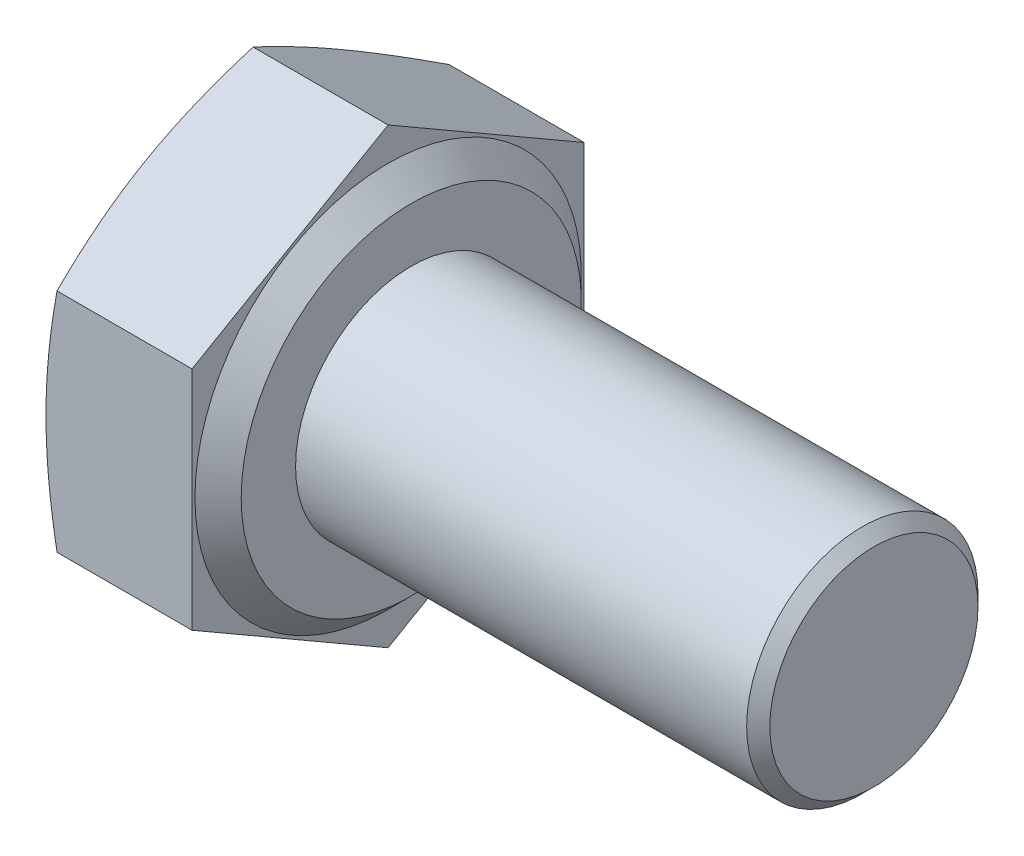
ISO-10303-21;
HEADER;
FILE_DESCRIPTION(('STEP AP214'),'2;1');
FILE_NAME('part.step','',(''),(''),'','','');
FILE_SCHEMA(('AUTOMOTIVE_DESIGN { 1 0 10303 214 1 1 1 1 }'));
ENDSEC;
DATA;
#1=APPLICATION_CONTEXT('core data for automotive mechanical design processes');
#2=APPLICATION_PROTOCOL_DEFINITION('international standard','automotive_design',2000,#1);
#3=PRODUCT_CONTEXT('',#1,'mechanical');
#4=PRODUCT('Part','Part','',(#3));
#5=PRODUCT_RELATED_PRODUCT_CATEGORY('part','',(#4));
#6=PRODUCT_DEFINITION_FORMATION('','',#4);
#7=PRODUCT_DEFINITION_CONTEXT('part definition',#1,'design');
#8=PRODUCT_DEFINITION('design','',#6,#7);
#9=PRODUCT_DEFINITION_SHAPE('','',#8);
#10=(LENGTH_UNIT() NAMED_UNIT(*) SI_UNIT(.MILLI.,.METRE.));
#11=(NAMED_UNIT(*) PLANE_ANGLE_UNIT() SI_UNIT($,.RADIAN.));
#12=(NAMED_UNIT(*) SI_UNIT($,.STERADIAN.) SOLID_ANGLE_UNIT());
#13=UNCERTAINTY_MEASURE_WITH_UNIT(LENGTH_MEASURE(1.E-05),#10,'distance_accuracy_value','');
#14=(GEOMETRIC_REPRESENTATION_CONTEXT(3) GLOBAL_UNCERTAINTY_ASSIGNED_CONTEXT((#13)) GLOBAL_UNIT_ASSIGNED_CONTEXT((#10,
#11,#12)) REPRESENTATION_CONTEXT('',''));
#15=CARTESIAN_POINT('',(0.,0.,0.));
#16=DIRECTION('',(0.,0.,1.));
#17=DIRECTION('',(1.,0.,0.));
#18=AXIS2_PLACEMENT_3D('',#15,#16,#17);
#19=CARTESIAN_POINT('',(2.925,-5.87165223765849,3.39));
#20=DIRECTION('',(-1.,0.,0.));
#21=DIRECTION('',(0.,0.,1.));
#22=AXIS2_PLACEMENT_3D('',#19,#20,#21);
#23=PLANE('',#22);
#24=CARTESIAN_POINT('',(2.925,0.,0.));
#25=DIRECTION('',(-1.,0.,0.));
#26=DIRECTION('',(0.,0.,1.));
#27=AXIS2_PLACEMENT_3D('',#24,#25,#26);
#28=CIRCLE('',#27,2.94);
#29=CARTESIAN_POINT('',(2.925,0.,2.94));
#30=VERTEX_POINT('',#29);
#31=EDGE_CURVE('E338',#30,#30,#28,.T.);
#32=ORIENTED_EDGE('',*,*,#31,.F.);
#33=EDGE_LOOP('',(#32));
#34=FACE_BOUND('',#33,.T.);
#35=CARTESIAN_POINT('',(2.925,0.,0.));
#36=DIRECTION('',(-1.,0.,0.));
#37=DIRECTION('',(0.,0.,1.));
#38=AXIS2_PLACEMENT_3D('',#35,#36,#37);
#39=CIRCLE('',#38,2.);
#40=CARTESIAN_POINT('',(2.925,0.,2.));
#41=VERTEX_POINT('',#40);
#42=EDGE_CURVE('E153',#41,#41,#39,.F.);
#43=ORIENTED_EDGE('',*,*,#42,.F.);
#44=EDGE_LOOP('',(#43));
#45=FACE_BOUND('',#44,.T.);
#46=ADVANCED_FACE('F37',(#34,#45),#23,.F.);
#47=CARTESIAN_POINT('',(2.925,-3.91443482510566,0.));
#48=DIRECTION('',(0.,0.866025403784439,0.5));
#49=DIRECTION('',(0.,-0.5,0.866025403784439));
#50=AXIS2_PLACEMENT_3D('',#47,#48,#49);
#51=PLANE('',#50);
#52=CARTESIAN_POINT('',(0.190920695673181,-1.957101942499,-3.3902));
#53=CARTESIAN_POINT('',(0.161404170530894,-2.03816412054654,-3.24979618904946));
#54=CARTESIAN_POINT('',(0.134553686064012,-2.11949362286094,-3.10892935888662));
#55=CARTESIAN_POINT('',(0.0873142945927187,-2.28268148917413,-2.82627968325342));
#56=CARTESIAN_POINT('',(0.0669304448507112,-2.36454021625955,-2.68449620889857));
#57=CARTESIAN_POINT('',(0.0339601092717296,-2.52787800101785,-2.40158686690143));
#58=CARTESIAN_POINT('',(0.0213017035221391,-2.6093533276861,-2.26046746154876));
#59=CARTESIAN_POINT('',(0.00432321252371582,-2.77249453116584,-1.97789860831391));
#60=CARTESIAN_POINT('',(0.,-2.85416032499754,-1.83644930415696));
#61=CARTESIAN_POINT('',(0.,-3.01749191266095,-1.55355069584304));
#62=CARTESIAN_POINT('',(0.00432321252371608,-3.09915770649266,-1.41210139168608));
#63=CARTESIAN_POINT('',(0.0213017035221394,-3.2622989099724,-1.12953253845124));
#64=CARTESIAN_POINT('',(0.0339601092717298,-3.34377423664064,-0.988413133098568));
#65=CARTESIAN_POINT('',(0.0669304448507115,-3.50711202139895,-0.705503791101429));
#66=CARTESIAN_POINT('',(0.0873142945927191,-3.58897074848437,-0.563720316746573));
#67=CARTESIAN_POINT('',(0.134553686064013,-3.75215861479756,-0.281070641113374));
#68=CARTESIAN_POINT('',(0.161404170530895,-3.83348811711196,-0.140203810950533));
#69=CARTESIAN_POINT('',(0.190920695673182,-3.9145502951595,0.000200000000001469));
#70=B_SPLINE_CURVE_WITH_KNOTS('',3,(#52,#53,#54,#55,#56,#57,#58,#59,#60,#61,#62,#63,#64,#65,#66,
#67,#68,#69),.UNSPECIFIED.,.F.,.F.,(4,2,2,2,2,2,2,2,4),(0.,0.494419076649432,0.989223868307329,
1.47934907283627,1.96929035184584,2.45923163085541,2.94935683538435,3.44416162704224,
3.93858070369168),.UNSPECIFIED.);
#71=CARTESIAN_POINT('',(0.19087866615106,-1.95721741255284,-3.39));
#72=VERTEX_POINT('',#71);
#73=CARTESIAN_POINT('',(0.,-2.93582611882925,-1.695));
#74=VERTEX_POINT('',#73);
#75=EDGE_CURVE('E116',#72,#74,#70,.T.);
#76=ORIENTED_EDGE('',*,*,#75,.F.);
#77=DIRECTION('',(-1.,0.,0.));
#78=VECTOR('',#77,1.);
#79=CARTESIAN_POINT('',(2.925,-1.95721741255283,-3.39));
#80=LINE('',#79,#78);
#81=CARTESIAN_POINT('',(2.525,-1.95721741255284,-3.39));
#82=VERTEX_POINT('',#81);
#83=EDGE_CURVE('E145',#82,#72,#80,.T.);
#84=ORIENTED_EDGE('',*,*,#83,.F.);
#85=DIRECTION('',(0.,0.5,-0.866025403784439));
#86=VECTOR('',#85,1.);
#87=CARTESIAN_POINT('',(2.525,-3.91443482510566,0.));
#88=LINE('',#87,#86);
#89=CARTESIAN_POINT('',(2.525,-3.91443482510566,0.));
#90=VERTEX_POINT('',#89);
#91=EDGE_CURVE('E353',#90,#82,#88,.T.);
#92=ORIENTED_EDGE('',*,*,#91,.F.);
#93=DIRECTION('',(-1.,0.,0.));
#94=VECTOR('',#93,1.);
#95=CARTESIAN_POINT('',(2.925,-3.91443482510566,0.));
#96=LINE('',#95,#94);
#97=CARTESIAN_POINT('',(0.19087866615106,-3.91443482510566,0.));
#98=VERTEX_POINT('',#97);
#99=EDGE_CURVE('E139',#90,#98,#96,.T.);
#100=ORIENTED_EDGE('',*,*,#99,.T.);
#101=EDGE_CURVE('E219',#74,#98,#70,.T.);
#102=ORIENTED_EDGE('',*,*,#101,.F.);
#103=EDGE_LOOP('',(#76,#84,#92,#100,#102));
#104=FACE_BOUND('',#103,.T.);
#105=ADVANCED_FACE('F169',(#104),#51,.F.);
#106=CARTESIAN_POINT('',(2.925,-1.95721741255283,-3.39));
#107=DIRECTION('',(0.,0.,1.));
#108=DIRECTION('',(1.,0.,0.));
#109=AXIS2_PLACEMENT_3D('',#106,#107,#108);
#110=PLANE('',#109);
#111=CARTESIAN_POINT('',(1.01997989354759,-5.18202350349092,-3.39));
#112=CARTESIAN_POINT('',(0.973277002242208,-5.02864764339971,-3.39));
#113=CARTESIAN_POINT('',(0.92711907287694,-4.87510275748851,-3.39));
#114=CARTESIAN_POINT('',(0.836194610175299,-4.56758888202956,-3.39));
#115=CARTESIAN_POINT('',(0.791428186940742,-4.41361985996635,-3.39));
#116=CARTESIAN_POINT('',(0.703513740136746,-4.1049081257591,-3.39));
#117=CARTESIAN_POINT('',(0.660368891930327,-3.9501645060724,-3.39));
#118=CARTESIAN_POINT('',(0.576202703755944,-3.64010163790345,-3.39));
#119=CARTESIAN_POINT('',(0.535181325660586,-3.48478239981026,-3.39));
#120=CARTESIAN_POINT('',(0.456277437117914,-3.17538416295869,-3.39));
#121=CARTESIAN_POINT('',(0.41836246095362,-3.02131348495736,-3.39));
#122=CARTESIAN_POINT('',(0.345760478621676,-2.71240531015016,-3.39));
#123=CARTESIAN_POINT('',(0.31107352977889,-2.55756779977793,-3.39));
#124=CARTESIAN_POINT('',(0.245736727919533,-2.24709331546656,-3.39));
#125=CARTESIAN_POINT('',(0.215085449738309,-2.09145664402713,-3.39));
#126=CARTESIAN_POINT('',(0.158752150984607,-1.7792761387277,-3.39));
#127=CARTESIAN_POINT('',(0.133070078323606,-1.62273231439442,-3.39));
#128=CARTESIAN_POINT('',(0.0902615531817825,-1.32636320569982,-3.39));
#129=CARTESIAN_POINT('',(0.0724987882413193,-1.18663069691262,-3.39));
#130=CARTESIAN_POINT('',(0.0424324881028117,-0.90658866966141,-3.39));
#131=CARTESIAN_POINT('',(0.0301282534946788,-0.766279227447352,-3.39));
#132=CARTESIAN_POINT('',(0.011568469310866,-0.485347204994704,-3.39));
#133=CARTESIAN_POINT('',(0.00530893988923395,-0.344724891973988,-3.39));
#134=CARTESIAN_POINT('',(-0.000843430608763747,-0.0633395865578567,-3.39));
#135=CARTESIAN_POINT('',(-0.000736316645791273,0.0774234048370808,-3.39));
#136=CARTESIAN_POINT('',(0.00585535977490544,0.35951181057951,-3.39));
#137=CARTESIAN_POINT('',(0.0123722627973913,0.500836456802892,-3.39));
#138=CARTESIAN_POINT('',(0.0314839573460978,0.783070507641829,-3.39));
#139=CARTESIAN_POINT('',(0.0440788948926863,0.923979902199433,-3.39));
#140=CARTESIAN_POINT('',(0.074756166127456,1.20531451424879,-3.39));
#141=CARTESIAN_POINT('',(0.0928432130380229,1.34573921068275,-3.39));
#142=CARTESIAN_POINT('',(0.133775937021106,1.62588419860853,-3.39));
#143=CARTESIAN_POINT('',(0.156621639598427,1.76560448632084,-3.39));
#144=CARTESIAN_POINT('',(0.233780310562574,2.19842531997454,-3.39));
#145=CARTESIAN_POINT('',(0.294955955630499,2.49029899907325,-3.39));
#146=CARTESIAN_POINT('',(0.429080881996318,3.07133579793218,-3.39));
#147=CARTESIAN_POINT('',(0.502034403900268,3.36049790156764,-3.39));
#148=CARTESIAN_POINT('',(0.655790287789297,3.93710836070672,-3.39));
#149=CARTESIAN_POINT('',(0.7366026830979,4.22455401473238,-3.39));
#150=CARTESIAN_POINT('',(0.903426263150167,4.79786794795153,-3.39));
#151=CARTESIAN_POINT('',(0.98943662300995,5.08373646960921,-3.39));
#152=CARTESIAN_POINT('',(1.16408508397131,5.65121216000977,-3.39));
#153=CARTESIAN_POINT('',(1.25268370134974,5.93283153633288,-3.39));
#154=CARTESIAN_POINT('',(1.43239756302466,6.49527837196232,-3.39));
#155=CARTESIAN_POINT('',(1.52351292806605,6.77610579255849,-3.39));
#156=CARTESIAN_POINT('',(1.70722886302289,7.33609287888211,-3.39));
#157=CARTESIAN_POINT('',(1.79982248576516,7.61525482955923,-3.39));
#158=CARTESIAN_POINT('',(1.98639802369662,8.17308924398157,-3.39));
#159=CARTESIAN_POINT('',(2.08037982391118,8.45176174614948,-3.39));
#160=CARTESIAN_POINT('',(2.17484728105455,8.73026714408882,-3.39));
#161=B_SPLINE_CURVE_WITH_KNOTS('',3,(#111,#112,#113,#114,#115,#116,#117,#118,#119,#120,#121,
#122,#123,#124,#125,#126,#127,#128,#129,#130,#131,#132,#133,#134,#135,#136,#137,#138,#139,#140,
#141,#142,#143,#144,#145,#146,#147,#148,#149,#150,#151,#152,#153,#154,#155,#156,#157,#158,#159,
#160),.UNSPECIFIED.,.F.,.F.,(4,2,2,2,2,2,2,2,2,2,2,2,2,2,2,2,2,2,2,2,2,2,2,2,4),(0.,
0.480989717785643,0.96201739712082,1.44394255408912,1.92585905497698,2.40183354492129,
2.87781648583752,3.35363088376765,3.82944029381557,4.25191845933479,4.67434247641531,
5.09648817867019,5.51863089977051,5.94291452361967,6.36720834108242,6.79186731337204,
7.21652856175054,8.11074113208824,9.00527638324548,9.90096905563468,10.7965199586567,
11.6821858830082,12.5678943726271,13.4502421784021,14.3325173097535),.UNSPECIFIED.);
#162=CARTESIAN_POINT('',(0.19087866615106,1.95721741255283,-3.39));
#163=VERTEX_POINT('',#162);
#164=CARTESIAN_POINT('',(0.,0.,-3.39));
#165=VERTEX_POINT('',#164);
#166=EDGE_CURVE('E231',#163,#165,#161,.F.);
#167=ORIENTED_EDGE('',*,*,#166,.F.);
#168=DIRECTION('',(-1.,0.,0.));
#169=VECTOR('',#168,1.);
#170=CARTESIAN_POINT('',(2.925,1.95721741255283,-3.39));
#171=LINE('',#170,#169);
#172=CARTESIAN_POINT('',(2.525,1.95721741255283,-3.39));
#173=VERTEX_POINT('',#172);
#174=EDGE_CURVE('E136',#173,#163,#171,.T.);
#175=ORIENTED_EDGE('',*,*,#174,.F.);
#176=DIRECTION('',(0.,1.,0.));
#177=VECTOR('',#176,1.);
#178=CARTESIAN_POINT('',(2.525,-1.95721741255283,-3.39));
#179=LINE('',#178,#177);
#180=EDGE_CURVE('E351',#82,#173,#179,.T.);
#181=ORIENTED_EDGE('',*,*,#180,.F.);
#182=ORIENTED_EDGE('',*,*,#83,.T.);
#183=EDGE_CURVE('E127',#165,#72,#161,.F.);
#184=ORIENTED_EDGE('',*,*,#183,.F.);
#185=EDGE_LOOP('',(#167,#175,#181,#182,#184));
#186=FACE_BOUND('',#185,.T.);
#187=ADVANCED_FACE('F175',(#186),#110,.F.);
#188=CARTESIAN_POINT('',(2.925,1.95721741255283,-3.39));
#189=DIRECTION('',(0.,-0.866025403784439,0.5));
#190=DIRECTION('',(0.,-0.5,-0.866025403784439));
#191=AXIS2_PLACEMENT_3D('',#188,#189,#190);
#192=PLANE('',#191);
#193=CARTESIAN_POINT('',(0.190920695673182,3.9145502951595,0.000199999999999883));
#194=CARTESIAN_POINT('',(0.161404170530895,3.83348811711196,-0.140203810950534));
#195=CARTESIAN_POINT('',(0.134553686064012,3.75215861479756,-0.281070641113376));
#196=CARTESIAN_POINT('',(0.0873142945927191,3.58897074848437,-0.563720316746575));
#197=CARTESIAN_POINT('',(0.0669304448507116,3.50711202139895,-0.705503791101431));
#198=CARTESIAN_POINT('',(0.03396010927173,3.34377423664064,-0.98841313309857));
#199=CARTESIAN_POINT('',(0.0213017035221395,3.2622989099724,-1.12953253845124));
#200=CARTESIAN_POINT('',(0.00432321252371619,3.09915770649266,-1.41210139168608));
#201=CARTESIAN_POINT('',(0.,3.01749191266095,-1.55355069584304));
#202=CARTESIAN_POINT('',(0.,2.85416032499754,-1.83644930415696));
#203=CARTESIAN_POINT('',(0.00432321252371606,2.77249453116584,-1.97789860831391));
#204=CARTESIAN_POINT('',(0.0213017035221394,2.6093533276861,-2.26046746154876));
#205=CARTESIAN_POINT('',(0.0339601092717298,2.52787800101785,-2.40158686690143));
#206=CARTESIAN_POINT('',(0.0669304448507114,2.36454021625955,-2.68449620889857));
#207=CARTESIAN_POINT('',(0.0873142945927189,2.28268148917413,-2.82627968325342));
#208=CARTESIAN_POINT('',(0.134553686064012,2.11949362286094,-3.10892935888662));
#209=CARTESIAN_POINT('',(0.161404170530895,2.03816412054654,-3.24979618904946));
#210=CARTESIAN_POINT('',(0.190920695673182,1.957101942499,-3.3902));
#211=B_SPLINE_CURVE_WITH_KNOTS('',3,(#193,#194,#195,#196,#197,#198,#199,#200,#201,#202,#203,
#204,#205,#206,#207,#208,#209,#210),.UNSPECIFIED.,.F.,.F.,(4,2,2,2,2,2,2,2,4),(0.,
0.494419076649432,0.989223868307329,1.47934907283627,1.96929035184584,2.45923163085541,
2.94935683538435,3.44416162704224,3.93858070369167),.UNSPECIFIED.);
#212=CARTESIAN_POINT('',(0.19087866615106,3.91443482510566,0.));
#213=VERTEX_POINT('',#212);
#214=CARTESIAN_POINT('',(0.,2.93582611882925,-1.695));
#215=VERTEX_POINT('',#214);
#216=EDGE_CURVE('E346',#213,#215,#211,.T.);
#217=ORIENTED_EDGE('',*,*,#216,.F.);
#218=DIRECTION('',(-1.,0.,0.));
#219=VECTOR('',#218,1.);
#220=CARTESIAN_POINT('',(2.925,3.91443482510566,0.));
#221=LINE('',#220,#219);
#222=CARTESIAN_POINT('',(2.525,3.91443482510566,0.));
#223=VERTEX_POINT('',#222);
#224=EDGE_CURVE('E133',#223,#213,#221,.T.);
#225=ORIENTED_EDGE('',*,*,#224,.F.);
#226=DIRECTION('',(0.,0.5,0.866025403784439));
#227=VECTOR('',#226,1.);
#228=CARTESIAN_POINT('',(2.525,1.95721741255283,-3.39));
#229=LINE('',#228,#227);
#230=EDGE_CURVE('E349',#173,#223,#229,.T.);
#231=ORIENTED_EDGE('',*,*,#230,.F.);
#232=ORIENTED_EDGE('',*,*,#174,.T.);
#233=EDGE_CURVE('E232',#215,#163,#211,.T.);
#234=ORIENTED_EDGE('',*,*,#233,.F.);
#235=EDGE_LOOP('',(#217,#225,#231,#232,#234));
#236=FACE_BOUND('',#235,.T.);
#237=ADVANCED_FACE('F240',(#236),#192,.F.);
#238=CARTESIAN_POINT('',(2.925,3.91443482510566,0.));
#239=DIRECTION('',(0.,-0.866025403784439,-0.5));
#240=DIRECTION('',(0.,0.5,-0.866025403784439));
#241=AXIS2_PLACEMENT_3D('',#238,#239,#240);
#242=PLANE('',#241);
#243=CARTESIAN_POINT('',(0.190920695673182,1.95710194249899,3.3902));
#244=CARTESIAN_POINT('',(0.161404170530895,2.03816412054653,3.24979618904947));
#245=CARTESIAN_POINT('',(0.134553686064013,2.11949362286094,3.10892935888663));
#246=CARTESIAN_POINT('',(0.0873142945927191,2.28268148917413,2.82627968325343));
#247=CARTESIAN_POINT('',(0.0669304448507115,2.36454021625954,2.68449620889857));
#248=CARTESIAN_POINT('',(0.0339601092717298,2.52787800101785,2.40158686690143));
#249=CARTESIAN_POINT('',(0.0213017035221394,2.6093533276861,2.26046746154876));
#250=CARTESIAN_POINT('',(0.00432321252371605,2.77249453116584,1.97789860831392));
#251=CARTESIAN_POINT('',(0.,2.85416032499754,1.83644930415696));
#252=CARTESIAN_POINT('',(0.,3.01749191266095,1.55355069584304));
#253=CARTESIAN_POINT('',(0.0043232125237161,3.09915770649266,1.41210139168609));
#254=CARTESIAN_POINT('',(0.0213017035221394,3.2622989099724,1.12953253845124));
#255=CARTESIAN_POINT('',(0.0339601092717298,3.34377423664064,0.98841313309857));
#256=CARTESIAN_POINT('',(0.0669304448507114,3.50711202139895,0.705503791101431));
#257=CARTESIAN_POINT('',(0.087314294592719,3.58897074848437,0.563720316746574));
#258=CARTESIAN_POINT('',(0.134553686064013,3.75215861479756,0.281070641113376));
#259=CARTESIAN_POINT('',(0.161404170530895,3.83348811711196,0.140203810950534));
#260=CARTESIAN_POINT('',(0.190920695673182,3.9145502951595,-0.000200000000000361));
#261=B_SPLINE_CURVE_WITH_KNOTS('',3,(#243,#244,#245,#246,#247,#248,#249,#250,#251,#252,#253,
#254,#255,#256,#257,#258,#259,#260),.UNSPECIFIED.,.F.,.F.,(4,2,2,2,2,2,2,2,4),(0.,
0.494419076649432,0.98922386830733,1.47934907283627,1.96929035184584,2.45923163085541,
2.94935683538435,3.44416162704225,3.93858070369168),.UNSPECIFIED.);
#262=CARTESIAN_POINT('',(0.19087866615106,1.95721741255283,3.39));
#263=VERTEX_POINT('',#262);
#264=CARTESIAN_POINT('',(0.,2.93582611882925,1.695));
#265=VERTEX_POINT('',#264);
#266=EDGE_CURVE('E111',#263,#265,#261,.T.);
#267=ORIENTED_EDGE('',*,*,#266,.F.);
#268=DIRECTION('',(-1.,0.,0.));
#269=VECTOR('',#268,1.);
#270=CARTESIAN_POINT('',(2.925,1.95721741255283,3.39));
#271=LINE('',#270,#269);
#272=CARTESIAN_POINT('',(2.525,1.95721741255283,3.39));
#273=VERTEX_POINT('',#272);
#274=EDGE_CURVE('E124',#273,#263,#271,.T.);
#275=ORIENTED_EDGE('',*,*,#274,.F.);
#276=DIRECTION('',(0.,-0.5,0.866025403784439));
#277=VECTOR('',#276,1.);
#278=CARTESIAN_POINT('',(2.525,3.91443482510566,0.));
#279=LINE('',#278,#277);
#280=EDGE_CURVE('E343',#223,#273,#279,.T.);
#281=ORIENTED_EDGE('',*,*,#280,.F.);
#282=ORIENTED_EDGE('',*,*,#224,.T.);
#283=EDGE_CURVE('E126',#265,#213,#261,.T.);
#284=ORIENTED_EDGE('',*,*,#283,.F.);
#285=EDGE_LOOP('',(#267,#275,#281,#282,#284));
#286=FACE_BOUND('',#285,.T.);
#287=ADVANCED_FACE('F122',(#286),#242,.F.);
#288=CARTESIAN_POINT('',(2.925,1.95721741255283,3.39));
#289=DIRECTION('',(0.,0.,-1.));
#290=DIRECTION('',(0.,1.,0.));
#291=AXIS2_PLACEMENT_3D('',#288,#289,#290);
#292=PLANE('',#291);
#293=CARTESIAN_POINT('',(1.01997989354759,-5.18202350349092,3.39));
#294=CARTESIAN_POINT('',(0.973277002242209,-5.02864764339971,3.39));
#295=CARTESIAN_POINT('',(0.927119072876941,-4.87510275748851,3.39));
#296=CARTESIAN_POINT('',(0.8361946101753,-4.56758888202956,3.39));
#297=CARTESIAN_POINT('',(0.791428186940742,-4.41361985996635,3.39));
#298=CARTESIAN_POINT('',(0.703513740136747,-4.1049081257591,3.39));
#299=CARTESIAN_POINT('',(0.660368891930328,-3.9501645060724,3.39));
#300=CARTESIAN_POINT('',(0.576202703755944,-3.64010163790345,3.39));
#301=CARTESIAN_POINT('',(0.535181325660586,-3.48478239981026,3.39));
#302=CARTESIAN_POINT('',(0.456277437117915,-3.17538416295869,3.39));
#303=CARTESIAN_POINT('',(0.418362460953621,-3.02131348495735,3.39));
#304=CARTESIAN_POINT('',(0.345760478621677,-2.71240531015016,3.39));
#305=CARTESIAN_POINT('',(0.311073529778891,-2.55756779977793,3.39));
#306=CARTESIAN_POINT('',(0.245736727919534,-2.24709331546656,3.39));
#307=CARTESIAN_POINT('',(0.21508544973831,-2.09145664402713,3.39));
#308=CARTESIAN_POINT('',(0.158752150984608,-1.7792761387277,3.39));
#309=CARTESIAN_POINT('',(0.133070078323607,-1.62273231439442,3.39));
#310=CARTESIAN_POINT('',(0.0902615531817834,-1.32636320569982,3.39));
#311=CARTESIAN_POINT('',(0.0724987882413204,-1.18663069691261,3.39));
#312=CARTESIAN_POINT('',(0.0424324881028129,-0.906588669661408,3.39));
#313=CARTESIAN_POINT('',(0.0301282534946798,-0.76627922744735,3.39));
#314=CARTESIAN_POINT('',(0.0115684693108671,-0.485347204994702,3.39));
#315=CARTESIAN_POINT('',(0.00530893988923521,-0.344724891973986,3.39));
#316=CARTESIAN_POINT('',(-0.000843430608762341,-0.0633395865578545,3.39));
#317=CARTESIAN_POINT('',(-0.000736316645789948,0.077423404837083,3.39));
#318=CARTESIAN_POINT('',(0.00585535977490682,0.359511810579512,3.39));
#319=CARTESIAN_POINT('',(0.0123722627973928,0.500836456802894,3.39));
#320=CARTESIAN_POINT('',(0.0314839573460993,0.783070507641831,3.39));
#321=CARTESIAN_POINT('',(0.0440788948926878,0.923979902199435,3.39));
#322=CARTESIAN_POINT('',(0.0747561661274576,1.2053145142488,3.39));
#323=CARTESIAN_POINT('',(0.0928432130380245,1.34573921068275,3.39));
#324=CARTESIAN_POINT('',(0.133775937021107,1.62588419860853,3.39));
#325=CARTESIAN_POINT('',(0.156621639598429,1.76560448632085,3.39));
#326=CARTESIAN_POINT('',(0.233780310562576,2.19842531997455,3.39));
#327=CARTESIAN_POINT('',(0.294955955630501,2.49029899907325,3.39));
#328=CARTESIAN_POINT('',(0.42908088199632,3.07133579793219,3.39));
#329=CARTESIAN_POINT('',(0.50203440390027,3.36049790156764,3.39));
#330=CARTESIAN_POINT('',(0.655790287789298,3.93710836070672,3.39));
#331=CARTESIAN_POINT('',(0.736602683097901,4.22455401473238,3.39));
#332=CARTESIAN_POINT('',(0.903426263150168,4.79786794795153,3.39));
#333=CARTESIAN_POINT('',(0.989436623009951,5.08373646960921,3.39));
#334=CARTESIAN_POINT('',(1.16408508397131,5.65121216000977,3.39));
#335=CARTESIAN_POINT('',(1.25268370134974,5.93283153633288,3.39));
#336=CARTESIAN_POINT('',(1.43239756302466,6.49527837196232,3.39));
#337=CARTESIAN_POINT('',(1.52351292806605,6.77610579255849,3.39));
#338=CARTESIAN_POINT('',(1.70722886302289,7.3360928788821,3.39));
#339=CARTESIAN_POINT('',(1.79982248576516,7.61525482955922,3.39));
#340=CARTESIAN_POINT('',(1.98639802369662,8.17308924398157,3.39));
#341=CARTESIAN_POINT('',(2.08037982391118,8.45176174614947,3.39));
#342=CARTESIAN_POINT('',(2.17484728105454,8.73026714408881,3.39));
#343=B_SPLINE_CURVE_WITH_KNOTS('',3,(#293,#294,#295,#296,#297,#298,#299,#300,#301,#302,#303,
#304,#305,#306,#307,#308,#309,#310,#311,#312,#313,#314,#315,#316,#317,#318,#319,#320,#321,#322,
#323,#324,#325,#326,#327,#328,#329,#330,#331,#332,#333,#334,#335,#336,#337,#338,#339,#340,#341,
#342),.UNSPECIFIED.,.F.,.F.,(4,2,2,2,2,2,2,2,2,2,2,2,2,2,2,2,2,2,2,2,2,2,2,2,4),(0.,
0.480989717785643,0.96201739712082,1.44394255408912,1.92585905497698,2.40183354492129,
2.87781648583752,3.35363088376765,3.82944029381557,4.25191845933479,4.67434247641531,
5.09648817867019,5.51863089977051,5.94291452361967,6.36720834108242,6.79186731337204,
7.21652856175055,8.11074113208825,9.00527638324549,9.90096905563469,10.7965199586567,
11.6821858830082,12.5678943726271,13.4502421784021,14.3325173097535),.UNSPECIFIED.);
#344=CARTESIAN_POINT('',(0.19087866615106,-1.95721741255283,3.39));
#345=VERTEX_POINT('',#344);
#346=CARTESIAN_POINT('',(0.,0.,3.39));
#347=VERTEX_POINT('',#346);
#348=EDGE_CURVE('E118',#345,#347,#343,.T.);
#349=ORIENTED_EDGE('',*,*,#348,.F.);
#350=DIRECTION('',(-1.,0.,0.));
#351=VECTOR('',#350,1.);
#352=CARTESIAN_POINT('',(2.925,-1.95721741255283,3.39));
#353=LINE('',#352,#351);
#354=CARTESIAN_POINT('',(2.525,-1.95721741255283,3.39));
#355=VERTEX_POINT('',#354);
#356=EDGE_CURVE('E134',#355,#345,#353,.T.);
#357=ORIENTED_EDGE('',*,*,#356,.F.);
#358=DIRECTION('',(0.,-1.,0.));
#359=VECTOR('',#358,1.);
#360=CARTESIAN_POINT('',(2.525,1.95721741255283,3.39));
#361=LINE('',#360,#359);
#362=EDGE_CURVE('E132',#273,#355,#361,.T.);
#363=ORIENTED_EDGE('',*,*,#362,.F.);
#364=ORIENTED_EDGE('',*,*,#274,.T.);
#365=EDGE_CURVE('E108',#347,#263,#343,.T.);
#366=ORIENTED_EDGE('',*,*,#365,.F.);
#367=EDGE_LOOP('',(#349,#357,#363,#364,#366));
#368=FACE_BOUND('',#367,.T.);
#369=ADVANCED_FACE('F130',(#368),#292,.F.);
#370=CARTESIAN_POINT('',(2.925,-1.95721741255283,3.39));
#371=DIRECTION('',(0.,0.866025403784439,-0.5));
#372=DIRECTION('',(0.,0.5,0.866025403784439));
#373=AXIS2_PLACEMENT_3D('',#370,#371,#372);
#374=PLANE('',#373);
#375=CARTESIAN_POINT('',(0.190920695673182,-3.9145502951595,-0.000199999999998737));
#376=CARTESIAN_POINT('',(0.161404170530895,-3.83348811711196,0.140203810950535));
#377=CARTESIAN_POINT('',(0.134553686064013,-3.75215861479756,0.281070641113377));
#378=CARTESIAN_POINT('',(0.0873142945927191,-3.58897074848437,0.563720316746576));
#379=CARTESIAN_POINT('',(0.0669304448507115,-3.50711202139895,0.705503791101433));
#380=CARTESIAN_POINT('',(0.0339601092717298,-3.34377423664064,0.988413133098571));
#381=CARTESIAN_POINT('',(0.0213017035221394,-3.2622989099724,1.12953253845124));
#382=CARTESIAN_POINT('',(0.00432321252371615,-3.09915770649266,1.41210139168609));
#383=CARTESIAN_POINT('',(0.,-3.01749191266095,1.55355069584304));
#384=CARTESIAN_POINT('',(0.,-2.85416032499754,1.83644930415696));
#385=CARTESIAN_POINT('',(0.00432321252371619,-2.77249453116584,1.97789860831392));
#386=CARTESIAN_POINT('',(0.0213017035221395,-2.6093533276861,2.26046746154876));
#387=CARTESIAN_POINT('',(0.03396010927173,-2.52787800101785,2.40158686690143));
#388=CARTESIAN_POINT('',(0.0669304448507116,-2.36454021625954,2.68449620889857));
#389=CARTESIAN_POINT('',(0.0873142945927192,-2.28268148917413,2.82627968325343));
#390=CARTESIAN_POINT('',(0.134553686064013,-2.11949362286094,3.10892935888663));
#391=CARTESIAN_POINT('',(0.161404170530895,-2.03816412054653,3.24979618904947));
#392=CARTESIAN_POINT('',(0.190920695673182,-1.95710194249899,3.3902));
#393=B_SPLINE_CURVE_WITH_KNOTS('',3,(#375,#376,#377,#378,#379,#380,#381,#382,#383,#384,#385,
#386,#387,#388,#389,#390,#391,#392),.UNSPECIFIED.,.F.,.F.,(4,2,2,2,2,2,2,2,4),(0.,
0.494419076649432,0.98922386830733,1.47934907283627,1.96929035184584,2.45923163085541,
2.94935683538435,3.44416162704224,3.93858070369168),.UNSPECIFIED.);
#394=CARTESIAN_POINT('',(0.,-2.93582611882925,1.695));
#395=VERTEX_POINT('',#394);
#396=EDGE_CURVE('E201',#98,#395,#393,.T.);
#397=ORIENTED_EDGE('',*,*,#396,.F.);
#398=ORIENTED_EDGE('',*,*,#99,.F.);
#399=DIRECTION('',(0.,-0.5,-0.866025403784439));
#400=VECTOR('',#399,1.);
#401=CARTESIAN_POINT('',(2.525,-1.95721741255283,3.39));
#402=LINE('',#401,#400);
#403=EDGE_CURVE('E148',#355,#90,#402,.T.);
#404=ORIENTED_EDGE('',*,*,#403,.F.);
#405=ORIENTED_EDGE('',*,*,#356,.T.);
#406=EDGE_CURVE('E195',#395,#345,#393,.T.);
#407=ORIENTED_EDGE('',*,*,#406,.F.);
#408=EDGE_LOOP('',(#397,#398,#404,#405,#407));
#409=FACE_BOUND('',#408,.T.);
#410=ADVANCED_FACE('F186',(#409),#374,.F.);
#411=CARTESIAN_POINT('',(2.525,3.34,0.));
#412=DIRECTION('',(1.,0.,0.));
#413=DIRECTION('',(0.,0.,-1.));
#414=AXIS2_PLACEMENT_3D('',#411,#412,#413);
#415=PLANE('',#414);
#416=CARTESIAN_POINT('',(2.525,0.,0.));
#417=DIRECTION('',(-1.,0.,0.));
#418=DIRECTION('',(0.,0.,1.));
#419=AXIS2_PLACEMENT_3D('',#416,#417,#418);
#420=CIRCLE('',#419,3.34);
#421=CARTESIAN_POINT('',(2.525,0.,3.34));
#422=VERTEX_POINT('',#421);
#423=EDGE_CURVE('E341',#422,#422,#420,.T.);
#424=ORIENTED_EDGE('',*,*,#423,.T.);
#425=EDGE_LOOP('',(#424));
#426=FACE_BOUND('',#425,.T.);
#427=ORIENTED_EDGE('',*,*,#91,.T.);
#428=ORIENTED_EDGE('',*,*,#180,.T.);
#429=ORIENTED_EDGE('',*,*,#230,.T.);
#430=ORIENTED_EDGE('',*,*,#280,.T.);
#431=ORIENTED_EDGE('',*,*,#362,.T.);
#432=ORIENTED_EDGE('',*,*,#403,.T.);
#433=EDGE_LOOP('',(#427,#428,#429,#430,#431,#432));
#434=FACE_BOUND('',#433,.T.);
#435=ADVANCED_FACE('F190',(#426,#434),#415,.T.);
#436=CARTESIAN_POINT('',(2.525,0.,0.));
#437=DIRECTION('',(-1.,0.,0.));
#438=DIRECTION('',(0.,0.,1.));
#439=AXIS2_PLACEMENT_3D('',#436,#437,#438);
#440=CONICAL_SURFACE('',#439,3.34,0.785398163397454);
#441=ORIENTED_EDGE('',*,*,#31,.T.);
#442=EDGE_LOOP('',(#441));
#443=FACE_BOUND('',#442,.T.);
#444=ORIENTED_EDGE('',*,*,#423,.F.);
#445=EDGE_LOOP('',(#444));
#446=FACE_BOUND('',#445,.T.);
#447=ADVANCED_FACE('F181',(#443,#446),#440,.T.);
#448=CARTESIAN_POINT('',(0.,0.,0.));
#449=DIRECTION('',(1.,0.,0.));
#450=DIRECTION('',(0.,0.,-1.));
#451=AXIS2_PLACEMENT_3D('',#448,#449,#450);
#452=CONICAL_SURFACE('',#451,3.39,1.22173047639604);
#453=ORIENTED_EDGE('',*,*,#348,.T.);
#454=CARTESIAN_POINT('',(0.,0.,0.));
#455=DIRECTION('',(-1.,0.,0.));
#456=DIRECTION('',(0.,0.,1.));
#457=AXIS2_PLACEMENT_3D('',#454,#455,#456);
#458=CIRCLE('',#457,3.39);
#459=EDGE_CURVE('E150',#395,#347,#458,.T.);
#460=ORIENTED_EDGE('',*,*,#459,.F.);
#461=ORIENTED_EDGE('',*,*,#406,.T.);
#462=EDGE_LOOP('',(#453,#460,#461));
#463=FACE_BOUND('',#462,.T.);
#464=ADVANCED_FACE('F212',(#463),#452,.T.);
#465=ORIENTED_EDGE('',*,*,#101,.T.);
#466=ORIENTED_EDGE('',*,*,#396,.T.);
#467=EDGE_CURVE('E60',#74,#395,#458,.T.);
#468=ORIENTED_EDGE('',*,*,#467,.F.);
#469=EDGE_LOOP('',(#465,#466,#468));
#470=FACE_BOUND('',#469,.T.);
#471=ADVANCED_FACE('F276',(#470),#452,.T.);
#472=ORIENTED_EDGE('',*,*,#183,.T.);
#473=ORIENTED_EDGE('',*,*,#75,.T.);
#474=EDGE_CURVE('E365',#165,#74,#458,.T.);
#475=ORIENTED_EDGE('',*,*,#474,.F.);
#476=EDGE_LOOP('',(#472,#473,#475));
#477=FACE_BOUND('',#476,.T.);
#478=ADVANCED_FACE('F283',(#477),#452,.T.);
#479=ORIENTED_EDGE('',*,*,#233,.T.);
#480=ORIENTED_EDGE('',*,*,#166,.T.);
#481=EDGE_CURVE('E370',#215,#165,#458,.T.);
#482=ORIENTED_EDGE('',*,*,#481,.F.);
#483=EDGE_LOOP('',(#479,#480,#482));
#484=FACE_BOUND('',#483,.T.);
#485=ADVANCED_FACE('F210',(#484),#452,.T.);
#486=ORIENTED_EDGE('',*,*,#216,.T.);
#487=EDGE_CURVE('E152',#265,#215,#458,.T.);
#488=ORIENTED_EDGE('',*,*,#487,.F.);
#489=ORIENTED_EDGE('',*,*,#283,.T.);
#490=EDGE_LOOP('',(#486,#488,#489));
#491=FACE_BOUND('',#490,.T.);
#492=ADVANCED_FACE('F206',(#491),#452,.T.);
#493=ORIENTED_EDGE('',*,*,#266,.T.);
#494=CARTESIAN_POINT('',(0.,0.,0.));
#495=DIRECTION('',(-1.,0.,0.));
#496=DIRECTION('',(0.,0.,1.));
#497=AXIS2_PLACEMENT_3D('',#494,#495,#496);
#498=CIRCLE('',#497,3.39);
#499=EDGE_CURVE('E52',#347,#265,#498,.T.);
#500=ORIENTED_EDGE('',*,*,#499,.F.);
#501=ORIENTED_EDGE('',*,*,#365,.T.);
#502=EDGE_LOOP('',(#493,#500,#501));
#503=FACE_BOUND('',#502,.T.);
#504=ADVANCED_FACE('F110',(#503),#452,.T.);
#505=CARTESIAN_POINT('',(0.,-5.87165223765849,3.39));
#506=DIRECTION('',(-1.,0.,0.));
#507=DIRECTION('',(0.,0.,1.));
#508=AXIS2_PLACEMENT_3D('',#505,#506,#507);
#509=PLANE('',#508);
#510=ORIENTED_EDGE('',*,*,#459,.T.);
#511=ORIENTED_EDGE('',*,*,#499,.T.);
#512=ORIENTED_EDGE('',*,*,#487,.T.);
#513=ORIENTED_EDGE('',*,*,#481,.T.);
#514=ORIENTED_EDGE('',*,*,#474,.T.);
#515=ORIENTED_EDGE('',*,*,#467,.T.);
#516=EDGE_LOOP('',(#510,#511,#512,#513,#514,#515));
#517=FACE_BOUND('',#516,.T.);
#518=ADVANCED_FACE('F183',(#517),#509,.T.);
#519=CARTESIAN_POINT('',(10.925,0.,0.));
#520=DIRECTION('',(-1.,0.,0.));
#521=DIRECTION('',(0.,0.,1.));
#522=AXIS2_PLACEMENT_3D('',#519,#520,#521);
#523=CYLINDRICAL_SURFACE('',#522,2.);
#524=CARTESIAN_POINT('',(10.725,0.,0.));
#525=DIRECTION('',(1.,0.,0.));
#526=DIRECTION('',(0.,0.,-1.));
#527=AXIS2_PLACEMENT_3D('',#524,#525,#526);
#528=CIRCLE('',#527,2.);
#529=CARTESIAN_POINT('',(10.725,0.,-2.));
#530=VERTEX_POINT('',#529);
#531=EDGE_CURVE('E11',#530,#530,#528,.F.);
#532=ORIENTED_EDGE('',*,*,#531,.T.);
#533=EDGE_LOOP('',(#532));
#534=FACE_BOUND('',#533,.T.);
#535=ORIENTED_EDGE('',*,*,#42,.T.);
#536=EDGE_LOOP('',(#535));
#537=FACE_BOUND('',#536,.T.);
#538=ADVANCED_FACE('F165',(#534,#537),#523,.T.);
#539=CARTESIAN_POINT('',(10.925,0.,0.));
#540=DIRECTION('',(1.,0.,0.));
#541=DIRECTION('',(0.,0.,-1.));
#542=AXIS2_PLACEMENT_3D('',#539,#540,#541);
#543=PLANE('',#542);
#544=CARTESIAN_POINT('',(10.925,0.,0.));
#545=DIRECTION('',(1.,0.,0.));
#546=DIRECTION('',(0.,0.,-1.));
#547=AXIS2_PLACEMENT_3D('',#544,#545,#546);
#548=CIRCLE('',#547,1.8);
#549=CARTESIAN_POINT('',(10.925,0.,-1.8));
#550=VERTEX_POINT('',#549);
#551=EDGE_CURVE('E45',#550,#550,#548,.T.);
#552=ORIENTED_EDGE('',*,*,#551,.T.);
#553=EDGE_LOOP('',(#552));
#554=FACE_BOUND('',#553,.T.);
#555=ADVANCED_FACE('F158',(#554),#543,.T.);
#556=CARTESIAN_POINT('',(10.925,0.,0.));
#557=DIRECTION('',(-1.,0.,0.));
#558=DIRECTION('',(0.,0.,1.));
#559=AXIS2_PLACEMENT_3D('',#556,#557,#558);
#560=CONICAL_SURFACE('',#559,1.8,0.785398163397444);
#561=ORIENTED_EDGE('',*,*,#531,.F.);
#562=EDGE_LOOP('',(#561));
#563=FACE_BOUND('',#562,.T.);
#564=ORIENTED_EDGE('',*,*,#551,.F.);
#565=EDGE_LOOP('',(#564));
#566=FACE_BOUND('',#565,.T.);
#567=ADVANCED_FACE('F39',(#563,#566),#560,.T.);
#568=CLOSED_SHELL('',(#46,#105,#187,#237,#287,#369,#410,#435,#447,#464,#471,#478,#485,#492,#504,
#518,#538,#555,#567));
#569=MANIFOLD_SOLID_BREP('B2',#568);
#570=ADVANCED_BREP_SHAPE_REPRESENTATION('',(#18,#569),#14);
#571=SHAPE_DEFINITION_REPRESENTATION(#9,#570);
ENDSEC;
END-ISO-10303-21;
